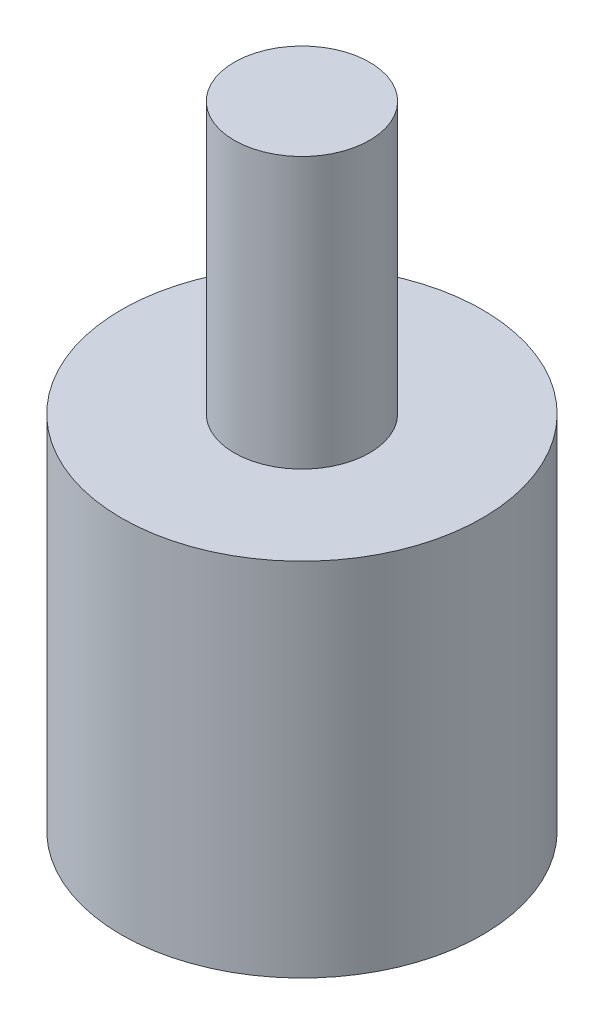
ISO-10303-21;
HEADER;
FILE_DESCRIPTION(('STEP AP214'),'2;1');
FILE_NAME('part.step','',(''),(''),'','','');
FILE_SCHEMA(('AUTOMOTIVE_DESIGN { 1 0 10303 214 1 1 1 1 }'));
ENDSEC;
DATA;
#1=APPLICATION_CONTEXT('core data for automotive mechanical design processes');
#2=APPLICATION_PROTOCOL_DEFINITION('international standard','automotive_design',2000,#1);
#3=PRODUCT_CONTEXT('',#1,'mechanical');
#4=PRODUCT('Part','Part','',(#3));
#5=PRODUCT_RELATED_PRODUCT_CATEGORY('part','',(#4));
#6=PRODUCT_DEFINITION_FORMATION('','',#4);
#7=PRODUCT_DEFINITION_CONTEXT('part definition',#1,'design');
#8=PRODUCT_DEFINITION('design','',#6,#7);
#9=PRODUCT_DEFINITION_SHAPE('','',#8);
#10=(LENGTH_UNIT() NAMED_UNIT(*) SI_UNIT(.MILLI.,.METRE.));
#11=(NAMED_UNIT(*) PLANE_ANGLE_UNIT() SI_UNIT($,.RADIAN.));
#12=(NAMED_UNIT(*) SI_UNIT($,.STERADIAN.) SOLID_ANGLE_UNIT());
#13=UNCERTAINTY_MEASURE_WITH_UNIT(LENGTH_MEASURE(1.E-05),#10,'distance_accuracy_value','');
#14=(GEOMETRIC_REPRESENTATION_CONTEXT(3) GLOBAL_UNCERTAINTY_ASSIGNED_CONTEXT((#13)) GLOBAL_UNIT_ASSIGNED_CONTEXT((#10,
#11,#12)) REPRESENTATION_CONTEXT('',''));
#15=CARTESIAN_POINT('',(0.,0.,0.));
#16=DIRECTION('',(0.,0.,1.));
#17=DIRECTION('',(1.,0.,0.));
#18=AXIS2_PLACEMENT_3D('',#15,#16,#17);
#19=CARTESIAN_POINT('',(0.,8.,0.));
#20=DIRECTION('',(0.,-1.,0.));
#21=DIRECTION('',(0.,0.,-1.));
#22=AXIS2_PLACEMENT_3D('',#19,#20,#21);
#23=CYLINDRICAL_SURFACE('',#22,4.);
#24=CARTESIAN_POINT('',(0.,8.,0.));
#25=DIRECTION('',(0.,1.,0.));
#26=DIRECTION('',(0.,0.,1.));
#27=AXIS2_PLACEMENT_3D('',#24,#25,#26);
#28=CIRCLE('',#27,4.);
#29=CARTESIAN_POINT('',(0.,8.,4.));
#30=VERTEX_POINT('',#29);
#31=EDGE_CURVE('E46',#30,#30,#28,.T.);
#32=ORIENTED_EDGE('',*,*,#31,.F.);
#33=EDGE_LOOP('',(#32));
#34=FACE_BOUND('',#33,.T.);
#35=CARTESIAN_POINT('',(0.,0.,0.));
#36=DIRECTION('',(0.,1.,0.));
#37=DIRECTION('',(0.,0.,1.));
#38=AXIS2_PLACEMENT_3D('',#35,#36,#37);
#39=CIRCLE('',#38,4.);
#40=CARTESIAN_POINT('',(0.,0.,4.));
#41=VERTEX_POINT('',#40);
#42=EDGE_CURVE('E41',#41,#41,#39,.T.);
#43=ORIENTED_EDGE('',*,*,#42,.T.);
#44=EDGE_LOOP('',(#43));
#45=FACE_BOUND('',#44,.T.);
#46=ADVANCED_FACE('F38',(#34,#45),#23,.T.);
#47=CARTESIAN_POINT('',(0.,8.,0.));
#48=DIRECTION('',(0.,1.,0.));
#49=DIRECTION('',(0.,0.,1.));
#50=AXIS2_PLACEMENT_3D('',#47,#48,#49);
#51=PLANE('',#50);
#52=CARTESIAN_POINT('',(0.,8.,0.));
#53=DIRECTION('',(0.,1.,0.));
#54=DIRECTION('',(0.,0.,1.));
#55=AXIS2_PLACEMENT_3D('',#52,#53,#54);
#56=CIRCLE('',#55,1.5);
#57=CARTESIAN_POINT('',(0.,8.,1.5));
#58=VERTEX_POINT('',#57);
#59=EDGE_CURVE('E10',#58,#58,#56,.T.);
#60=ORIENTED_EDGE('',*,*,#59,.F.);
#61=EDGE_LOOP('',(#60));
#62=FACE_BOUND('',#61,.T.);
#63=ORIENTED_EDGE('',*,*,#31,.T.);
#64=EDGE_LOOP('',(#63));
#65=FACE_BOUND('',#64,.T.);
#66=ADVANCED_FACE('F70',(#62,#65),#51,.T.);
#67=CARTESIAN_POINT('',(0.,0.,0.));
#68=DIRECTION('',(0.,1.,0.));
#69=DIRECTION('',(0.,0.,1.));
#70=AXIS2_PLACEMENT_3D('',#67,#68,#69);
#71=PLANE('',#70);
#72=ORIENTED_EDGE('',*,*,#42,.F.);
#73=EDGE_LOOP('',(#72));
#74=FACE_BOUND('',#73,.T.);
#75=ADVANCED_FACE('F67',(#74),#71,.F.);
#76=CARTESIAN_POINT('',(0.,14.,0.));
#77=DIRECTION('',(0.,-1.,0.));
#78=DIRECTION('',(0.,0.,-1.));
#79=AXIS2_PLACEMENT_3D('',#76,#77,#78);
#80=CYLINDRICAL_SURFACE('',#79,1.5);
#81=CARTESIAN_POINT('',(0.,14.,0.));
#82=DIRECTION('',(0.,1.,0.));
#83=DIRECTION('',(0.,0.,1.));
#84=AXIS2_PLACEMENT_3D('',#81,#82,#83);
#85=CIRCLE('',#84,1.5);
#86=CARTESIAN_POINT('',(0.,14.,1.5));
#87=VERTEX_POINT('',#86);
#88=EDGE_CURVE('E54',#87,#87,#85,.T.);
#89=ORIENTED_EDGE('',*,*,#88,.F.);
#90=EDGE_LOOP('',(#89));
#91=FACE_BOUND('',#90,.T.);
#92=ORIENTED_EDGE('',*,*,#59,.T.);
#93=EDGE_LOOP('',(#92));
#94=FACE_BOUND('',#93,.T.);
#95=ADVANCED_FACE('F69',(#91,#94),#80,.T.);
#96=CARTESIAN_POINT('',(0.,14.,0.));
#97=DIRECTION('',(0.,1.,0.));
#98=DIRECTION('',(0.,0.,1.));
#99=AXIS2_PLACEMENT_3D('',#96,#97,#98);
#100=PLANE('',#99);
#101=ORIENTED_EDGE('',*,*,#88,.T.);
#102=EDGE_LOOP('',(#101));
#103=FACE_BOUND('',#102,.T.);
#104=ADVANCED_FACE('F75',(#103),#100,.T.);
#105=CLOSED_SHELL('',(#46,#66,#75,#95,#104));
#106=MANIFOLD_SOLID_BREP('B2',#105);
#107=ADVANCED_BREP_SHAPE_REPRESENTATION('',(#18,#106),#14);
#108=SHAPE_DEFINITION_REPRESENTATION(#9,#107);
ENDSEC;
END-ISO-10303-21;
